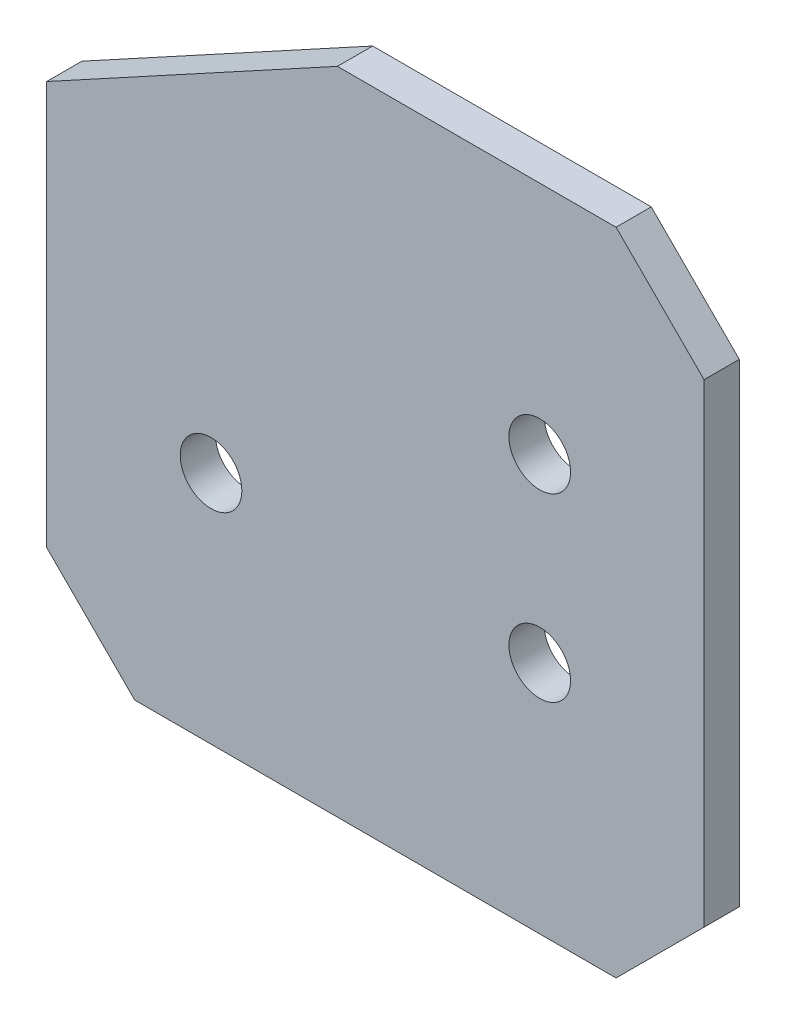
ISO-10303-21;
HEADER;
FILE_DESCRIPTION(('STEP AP214'),'2;1');
FILE_NAME('part.step','',(''),(''),'','','');
FILE_SCHEMA(('AUTOMOTIVE_DESIGN { 1 0 10303 214 1 1 1 1 }'));
ENDSEC;
DATA;
#1=APPLICATION_CONTEXT('core data for automotive mechanical design processes');
#2=APPLICATION_PROTOCOL_DEFINITION('international standard','automotive_design',2000,#1);
#3=PRODUCT_CONTEXT('',#1,'mechanical');
#4=PRODUCT('Part','Part','',(#3));
#5=PRODUCT_RELATED_PRODUCT_CATEGORY('part','',(#4));
#6=PRODUCT_DEFINITION_FORMATION('','',#4);
#7=PRODUCT_DEFINITION_CONTEXT('part definition',#1,'design');
#8=PRODUCT_DEFINITION('design','',#6,#7);
#9=PRODUCT_DEFINITION_SHAPE('','',#8);
#10=(LENGTH_UNIT() NAMED_UNIT(*) SI_UNIT(.MILLI.,.METRE.));
#11=(NAMED_UNIT(*) PLANE_ANGLE_UNIT() SI_UNIT($,.RADIAN.));
#12=(NAMED_UNIT(*) SI_UNIT($,.STERADIAN.) SOLID_ANGLE_UNIT());
#13=UNCERTAINTY_MEASURE_WITH_UNIT(LENGTH_MEASURE(1.E-05),#10,'distance_accuracy_value','');
#14=(GEOMETRIC_REPRESENTATION_CONTEXT(3) GLOBAL_UNCERTAINTY_ASSIGNED_CONTEXT((#13)) GLOBAL_UNIT_ASSIGNED_CONTEXT((#10,
#11,#12)) REPRESENTATION_CONTEXT('',''));
#15=CARTESIAN_POINT('',(0.,0.,0.));
#16=DIRECTION('',(0.,0.,1.));
#17=DIRECTION('',(1.,0.,0.));
#18=AXIS2_PLACEMENT_3D('',#15,#16,#17);
#19=CARTESIAN_POINT('',(55.9999999999995,3.00000000000045,-6.00000000000001));
#20=DIRECTION('',(1.,0.,0.));
#21=DIRECTION('',(0.,1.,0.));
#22=AXIS2_PLACEMENT_3D('',#19,#20,#21);
#23=PLANE('',#22);
#24=DIRECTION('',(0.,1.,0.));
#25=VECTOR('',#24,1.);
#26=CARTESIAN_POINT('',(55.9999999999995,3.00000000000045,0.));
#27=LINE('',#26,#25);
#28=CARTESIAN_POINT('',(55.9999999999993,18.0000000000005,0.));
#29=VERTEX_POINT('',#28);
#30=CARTESIAN_POINT('',(55.9999999999988,98.7738106804796,0.));
#31=VERTEX_POINT('',#30);
#32=EDGE_CURVE('E118',#29,#31,#27,.T.);
#33=ORIENTED_EDGE('',*,*,#32,.F.);
#34=DIRECTION('',(0.,0.,-1.));
#35=VECTOR('',#34,1.);
#36=CARTESIAN_POINT('',(55.9999999999993,18.0000000000005,-6.00000000000001));
#37=LINE('',#36,#35);
#38=CARTESIAN_POINT('',(55.9999999999993,18.0000000000005,-6.00000000000001));
#39=VERTEX_POINT('',#38);
#40=EDGE_CURVE('E143',#29,#39,#37,.T.);
#41=ORIENTED_EDGE('',*,*,#40,.T.);
#42=DIRECTION('',(0.,1.,0.));
#43=VECTOR('',#42,1.);
#44=CARTESIAN_POINT('',(55.9999999999995,3.00000000000045,-6.00000000000001));
#45=LINE('',#44,#43);
#46=CARTESIAN_POINT('',(55.9999999999988,98.7738106804796,-6.00000000000001));
#47=VERTEX_POINT('',#46);
#48=EDGE_CURVE('E128',#39,#47,#45,.T.);
#49=ORIENTED_EDGE('',*,*,#48,.T.);
#50=DIRECTION('',(0.,0.,1.));
#51=VECTOR('',#50,1.);
#52=CARTESIAN_POINT('',(55.9999999999988,98.7738106804796,-6.00000000000001));
#53=LINE('',#52,#51);
#54=EDGE_CURVE('E140',#47,#31,#53,.T.);
#55=ORIENTED_EDGE('',*,*,#54,.T.);
#56=EDGE_LOOP('',(#33,#41,#49,#55));
#57=FACE_BOUND('',#56,.T.);
#58=ADVANCED_FACE('F38',(#57),#23,.T.);
#59=CARTESIAN_POINT('',(55.9999999999995,3.00000000000045,-6.00000000000001));
#60=DIRECTION('',(0.,-1.,0.));
#61=DIRECTION('',(1.,0.,0.));
#62=AXIS2_PLACEMENT_3D('',#59,#60,#61);
#63=PLANE('',#62);
#64=DIRECTION('',(1.,0.,0.));
#65=VECTOR('',#64,1.);
#66=CARTESIAN_POINT('',(55.9999999999995,3.00000000000045,-6.00000000000001));
#67=LINE('',#66,#65);
#68=CARTESIAN_POINT('',(-40.9999999999994,3.00000000000006,-6.00000000000001));
#69=VERTEX_POINT('',#68);
#70=CARTESIAN_POINT('',(40.9999999999995,3.00000000000039,-6.00000000000001));
#71=VERTEX_POINT('',#70);
#72=EDGE_CURVE('E132',#69,#71,#67,.T.);
#73=ORIENTED_EDGE('',*,*,#72,.T.);
#74=DIRECTION('',(0.,0.,1.));
#75=VECTOR('',#74,1.);
#76=CARTESIAN_POINT('',(40.9999999999995,3.00000000000039,-6.00000000000001));
#77=LINE('',#76,#75);
#78=CARTESIAN_POINT('',(40.9999999999995,3.00000000000039,0.));
#79=VERTEX_POINT('',#78);
#80=EDGE_CURVE('E131',#71,#79,#77,.T.);
#81=ORIENTED_EDGE('',*,*,#80,.T.);
#82=DIRECTION('',(1.,0.,0.));
#83=VECTOR('',#82,1.);
#84=CARTESIAN_POINT('',(55.9999999999995,3.00000000000045,0.));
#85=LINE('',#84,#83);
#86=CARTESIAN_POINT('',(-40.9999999999994,3.00000000000006,0.));
#87=VERTEX_POINT('',#86);
#88=EDGE_CURVE('E120',#87,#79,#85,.T.);
#89=ORIENTED_EDGE('',*,*,#88,.F.);
#90=DIRECTION('',(0.,0.,-1.));
#91=VECTOR('',#90,1.);
#92=CARTESIAN_POINT('',(-40.9999999999994,3.00000000000006,-6.00000000000001));
#93=LINE('',#92,#91);
#94=EDGE_CURVE('E129',#87,#69,#93,.T.);
#95=ORIENTED_EDGE('',*,*,#94,.T.);
#96=EDGE_LOOP('',(#73,#81,#89,#95));
#97=FACE_BOUND('',#96,.T.);
#98=ADVANCED_FACE('F165',(#97),#63,.T.);
#99=CARTESIAN_POINT('',(-55.9999999999995,3.,-6.00000000000001));
#100=DIRECTION('',(-1.,0.,0.));
#101=DIRECTION('',(0.,0.,1.));
#102=AXIS2_PLACEMENT_3D('',#99,#100,#101);
#103=PLANE('',#102);
#104=DIRECTION('',(0.,0.,1.));
#105=VECTOR('',#104,1.);
#106=CARTESIAN_POINT('',(-55.9999999999995,86.7684486211549,-10.));
#107=LINE('',#106,#105);
#108=CARTESIAN_POINT('',(-55.9999999999995,86.7684486211549,-6.00000000000001));
#109=VERTEX_POINT('',#108);
#110=CARTESIAN_POINT('',(-55.9999999999995,86.7684486211549,0.));
#111=VERTEX_POINT('',#110);
#112=EDGE_CURVE('E53',#109,#111,#107,.T.);
#113=ORIENTED_EDGE('',*,*,#112,.F.);
#114=DIRECTION('',(0.,-1.,0.));
#115=VECTOR('',#114,1.);
#116=CARTESIAN_POINT('',(-55.9999999999995,3.,-6.00000000000001));
#117=LINE('',#116,#115);
#118=CARTESIAN_POINT('',(-55.9999999999995,17.9999999999999,-6.00000000000001));
#119=VERTEX_POINT('',#118);
#120=EDGE_CURVE('E156',#109,#119,#117,.T.);
#121=ORIENTED_EDGE('',*,*,#120,.T.);
#122=DIRECTION('',(0.,0.,1.));
#123=VECTOR('',#122,1.);
#124=CARTESIAN_POINT('',(-55.9999999999995,17.9999999999999,-6.00000000000001));
#125=LINE('',#124,#123);
#126=CARTESIAN_POINT('',(-55.9999999999995,17.9999999999999,0.));
#127=VERTEX_POINT('',#126);
#128=EDGE_CURVE('E46',#119,#127,#125,.T.);
#129=ORIENTED_EDGE('',*,*,#128,.T.);
#130=DIRECTION('',(0.,-1.,0.));
#131=VECTOR('',#130,1.);
#132=CARTESIAN_POINT('',(-55.9999999999995,3.,0.));
#133=LINE('',#132,#131);
#134=EDGE_CURVE('E117',#111,#127,#133,.T.);
#135=ORIENTED_EDGE('',*,*,#134,.F.);
#136=EDGE_LOOP('',(#113,#121,#129,#135));
#137=FACE_BOUND('',#136,.T.);
#138=ADVANCED_FACE('F154',(#137),#103,.T.);
#139=CARTESIAN_POINT('',(-55.9999999999995,113.773810680479,-6.00000000000001));
#140=DIRECTION('',(0.,1.,0.));
#141=DIRECTION('',(-1.,0.,0.));
#142=AXIS2_PLACEMENT_3D('',#139,#140,#141);
#143=PLANE('',#142);
#144=DIRECTION('',(0.,0.,1.));
#145=VECTOR('',#144,1.);
#146=CARTESIAN_POINT('',(-6.46850911170526,113.773810680479,-10.));
#147=LINE('',#146,#145);
#148=CARTESIAN_POINT('',(-6.46850911170526,113.773810680479,-6.00000000000001));
#149=VERTEX_POINT('',#148);
#150=CARTESIAN_POINT('',(-6.46850911170526,113.773810680479,0.));
#151=VERTEX_POINT('',#150);
#152=EDGE_CURVE('E103',#149,#151,#147,.T.);
#153=ORIENTED_EDGE('',*,*,#152,.T.);
#154=DIRECTION('',(-1.,0.,0.));
#155=VECTOR('',#154,1.);
#156=CARTESIAN_POINT('',(-55.9999999999995,113.773810680479,0.));
#157=LINE('',#156,#155);
#158=CARTESIAN_POINT('',(40.9999999999986,113.77381068048,0.));
#159=VERTEX_POINT('',#158);
#160=EDGE_CURVE('E110',#159,#151,#157,.T.);
#161=ORIENTED_EDGE('',*,*,#160,.F.);
#162=DIRECTION('',(0.,0.,-1.));
#163=VECTOR('',#162,1.);
#164=CARTESIAN_POINT('',(40.9999999999986,113.77381068048,-6.00000000000001));
#165=LINE('',#164,#163);
#166=CARTESIAN_POINT('',(40.9999999999986,113.77381068048,-6.00000000000001));
#167=VERTEX_POINT('',#166);
#168=EDGE_CURVE('E11',#159,#167,#165,.T.);
#169=ORIENTED_EDGE('',*,*,#168,.T.);
#170=DIRECTION('',(-1.,0.,0.));
#171=VECTOR('',#170,1.);
#172=CARTESIAN_POINT('',(-55.9999999999995,113.773810680479,-6.00000000000001));
#173=LINE('',#172,#171);
#174=EDGE_CURVE('E111',#167,#149,#173,.T.);
#175=ORIENTED_EDGE('',*,*,#174,.T.);
#176=EDGE_LOOP('',(#153,#161,#169,#175));
#177=FACE_BOUND('',#176,.T.);
#178=ADVANCED_FACE('F109',(#177),#143,.T.);
#179=CARTESIAN_POINT('',(0.,0.,-6.00000000000001));
#180=DIRECTION('',(0.,0.,-1.));
#181=DIRECTION('',(-1.,0.,0.));
#182=AXIS2_PLACEMENT_3D('',#179,#180,#181);
#183=PLANE('',#182);
#184=DIRECTION('',(-0.877983597106914,-0.478690717699021,0.));
#185=VECTOR('',#184,1.);
#186=CARTESIAN_POINT('',(-49.2993780104589,90.421735037635,-6.00000000000001));
#187=LINE('',#186,#185);
#188=EDGE_CURVE('E112',#149,#109,#187,.T.);
#189=ORIENTED_EDGE('',*,*,#188,.F.);
#190=ORIENTED_EDGE('',*,*,#174,.F.);
#191=DIRECTION('',(-0.707106781186551,0.707106781186544,0.));
#192=VECTOR('',#191,1.);
#193=CARTESIAN_POINT('',(77.3869053402389,77.3869053402397,-6.00000000000001));
#194=LINE('',#193,#192);
#195=EDGE_CURVE('E145',#167,#47,#194,.F.);
#196=ORIENTED_EDGE('',*,*,#195,.T.);
#197=ORIENTED_EDGE('',*,*,#48,.F.);
#198=DIRECTION('',(0.707106781186542,0.707106781186553,0.));
#199=VECTOR('',#198,1.);
#200=CARTESIAN_POINT('',(18.9999999999999,-18.9999999999996,-6.00000000000001));
#201=LINE('',#200,#199);
#202=EDGE_CURVE('E150',#39,#71,#201,.F.);
#203=ORIENTED_EDGE('',*,*,#202,.T.);
#204=ORIENTED_EDGE('',*,*,#72,.F.);
#205=DIRECTION('',(0.707106781186552,-0.707106781186543,0.));
#206=VECTOR('',#205,1.);
#207=CARTESIAN_POINT('',(-18.9999999999994,-18.9999999999997,-6.00000000000001));
#208=LINE('',#207,#206);
#209=EDGE_CURVE('E147',#69,#119,#208,.F.);
#210=ORIENTED_EDGE('',*,*,#209,.T.);
#211=ORIENTED_EDGE('',*,*,#120,.F.);
#212=EDGE_LOOP('',(#189,#190,#196,#197,#203,#204,#210,#211));
#213=FACE_BOUND('',#212,.T.);
#214=CARTESIAN_POINT('',(27.9999999999997,43.,-6.00000000000001));
#215=DIRECTION('',(0.,0.,1.));
#216=DIRECTION('',(-1.,0.,0.));
#217=AXIS2_PLACEMENT_3D('',#214,#215,#216);
#218=CIRCLE('',#217,5.25);
#219=CARTESIAN_POINT('',(22.7499999999997,43.,-6.00000000000001));
#220=VERTEX_POINT('',#219);
#221=EDGE_CURVE('E195',#220,#220,#218,.T.);
#222=ORIENTED_EDGE('',*,*,#221,.T.);
#223=EDGE_LOOP('',(#222));
#224=FACE_BOUND('',#223,.T.);
#225=CARTESIAN_POINT('',(27.9999999999994,73.7738106804792,-6.00000000000001));
#226=DIRECTION('',(0.,0.,1.));
#227=DIRECTION('',(-1.,0.,0.));
#228=AXIS2_PLACEMENT_3D('',#225,#226,#227);
#229=CIRCLE('',#228,5.25000000000001);
#230=CARTESIAN_POINT('',(22.7499999999994,73.7738106804792,-6.00000000000001));
#231=VERTEX_POINT('',#230);
#232=EDGE_CURVE('E189',#231,#231,#229,.T.);
#233=ORIENTED_EDGE('',*,*,#232,.T.);
#234=EDGE_LOOP('',(#233));
#235=FACE_BOUND('',#234,.T.);
#236=CARTESIAN_POINT('',(-28.,43.,-6.00000000000001));
#237=DIRECTION('',(0.,0.,1.));
#238=DIRECTION('',(1.,0.,0.));
#239=AXIS2_PLACEMENT_3D('',#236,#237,#238);
#240=CIRCLE('',#239,5.25);
#241=CARTESIAN_POINT('',(-22.75,43.,-6.00000000000001));
#242=VERTEX_POINT('',#241);
#243=EDGE_CURVE('E122',#242,#242,#240,.T.);
#244=ORIENTED_EDGE('',*,*,#243,.T.);
#245=EDGE_LOOP('',(#244));
#246=FACE_BOUND('',#245,.T.);
#247=ADVANCED_FACE('F180',(#213,#224,#235,#246),#183,.T.);
#248=CARTESIAN_POINT('',(0.,0.,0.));
#249=DIRECTION('',(0.,0.,-1.));
#250=DIRECTION('',(-1.,0.,0.));
#251=AXIS2_PLACEMENT_3D('',#248,#249,#250);
#252=PLANE('',#251);
#253=CARTESIAN_POINT('',(27.9999999999997,43.,0.));
#254=DIRECTION('',(0.,0.,1.));
#255=DIRECTION('',(-1.,0.,0.));
#256=AXIS2_PLACEMENT_3D('',#253,#254,#255);
#257=CIRCLE('',#256,5.25);
#258=CARTESIAN_POINT('',(22.7499999999997,43.,0.));
#259=VERTEX_POINT('',#258);
#260=EDGE_CURVE('E198',#259,#259,#257,.T.);
#261=ORIENTED_EDGE('',*,*,#260,.F.);
#262=EDGE_LOOP('',(#261));
#263=FACE_BOUND('',#262,.T.);
#264=CARTESIAN_POINT('',(27.9999999999994,73.7738106804792,0.));
#265=DIRECTION('',(0.,0.,1.));
#266=DIRECTION('',(-1.,0.,0.));
#267=AXIS2_PLACEMENT_3D('',#264,#265,#266);
#268=CIRCLE('',#267,5.25000000000001);
#269=CARTESIAN_POINT('',(22.7499999999994,73.7738106804792,0.));
#270=VERTEX_POINT('',#269);
#271=EDGE_CURVE('E192',#270,#270,#268,.T.);
#272=ORIENTED_EDGE('',*,*,#271,.F.);
#273=EDGE_LOOP('',(#272));
#274=FACE_BOUND('',#273,.T.);
#275=CARTESIAN_POINT('',(-28.,43.,0.));
#276=DIRECTION('',(0.,0.,1.));
#277=DIRECTION('',(1.,0.,0.));
#278=AXIS2_PLACEMENT_3D('',#275,#276,#277);
#279=CIRCLE('',#278,5.25);
#280=CARTESIAN_POINT('',(-22.75,43.,0.));
#281=VERTEX_POINT('',#280);
#282=EDGE_CURVE('E186',#281,#281,#279,.T.);
#283=ORIENTED_EDGE('',*,*,#282,.F.);
#284=EDGE_LOOP('',(#283));
#285=FACE_BOUND('',#284,.T.);
#286=ORIENTED_EDGE('',*,*,#160,.T.);
#287=DIRECTION('',(0.877983597106914,0.478690717699021,0.));
#288=VECTOR('',#287,1.);
#289=CARTESIAN_POINT('',(-55.9999999999995,86.7684486211549,0.));
#290=LINE('',#289,#288);
#291=EDGE_CURVE('E100',#111,#151,#290,.T.);
#292=ORIENTED_EDGE('',*,*,#291,.F.);
#293=ORIENTED_EDGE('',*,*,#134,.T.);
#294=DIRECTION('',(-0.707106781186552,0.707106781186543,0.));
#295=VECTOR('',#294,1.);
#296=CARTESIAN_POINT('',(-55.9999999999995,17.9999999999999,0.));
#297=LINE('',#296,#295);
#298=EDGE_CURVE('E136',#127,#87,#297,.F.);
#299=ORIENTED_EDGE('',*,*,#298,.T.);
#300=ORIENTED_EDGE('',*,*,#88,.T.);
#301=DIRECTION('',(-0.707106781186542,-0.707106781186553,0.));
#302=VECTOR('',#301,1.);
#303=CARTESIAN_POINT('',(40.9999999999995,3.00000000000039,0.));
#304=LINE('',#303,#302);
#305=EDGE_CURVE('E138',#79,#29,#304,.F.);
#306=ORIENTED_EDGE('',*,*,#305,.T.);
#307=ORIENTED_EDGE('',*,*,#32,.T.);
#308=DIRECTION('',(0.707106781186551,-0.707106781186544,0.));
#309=VECTOR('',#308,1.);
#310=CARTESIAN_POINT('',(55.9999999999988,98.7738106804796,0.));
#311=LINE('',#310,#309);
#312=EDGE_CURVE('E116',#31,#159,#311,.F.);
#313=ORIENTED_EDGE('',*,*,#312,.T.);
#314=EDGE_LOOP('',(#286,#292,#293,#299,#300,#306,#307,#313));
#315=FACE_BOUND('',#314,.T.);
#316=ADVANCED_FACE('F114',(#263,#274,#285,#315),#252,.F.);
#317=CARTESIAN_POINT('',(-28.,43.,-6.00000000000001));
#318=DIRECTION('',(0.,0.,1.));
#319=DIRECTION('',(1.,0.,0.));
#320=AXIS2_PLACEMENT_3D('',#317,#318,#319);
#321=CYLINDRICAL_SURFACE('',#320,5.25);
#322=ORIENTED_EDGE('',*,*,#243,.F.);
#323=EDGE_LOOP('',(#322));
#324=FACE_BOUND('',#323,.T.);
#325=ORIENTED_EDGE('',*,*,#282,.T.);
#326=EDGE_LOOP('',(#325));
#327=FACE_BOUND('',#326,.T.);
#328=ADVANCED_FACE('F216',(#324,#327),#321,.F.);
#329=CARTESIAN_POINT('',(27.9999999999994,73.7738106804792,-6.00000000000001));
#330=DIRECTION('',(0.,0.,1.));
#331=DIRECTION('',(1.,0.,0.));
#332=AXIS2_PLACEMENT_3D('',#329,#330,#331);
#333=CYLINDRICAL_SURFACE('',#332,5.25000000000001);
#334=ORIENTED_EDGE('',*,*,#232,.F.);
#335=EDGE_LOOP('',(#334));
#336=FACE_BOUND('',#335,.T.);
#337=ORIENTED_EDGE('',*,*,#271,.T.);
#338=EDGE_LOOP('',(#337));
#339=FACE_BOUND('',#338,.T.);
#340=ADVANCED_FACE('F210',(#336,#339),#333,.F.);
#341=CARTESIAN_POINT('',(27.9999999999997,43.,-6.00000000000001));
#342=DIRECTION('',(0.,0.,1.));
#343=DIRECTION('',(1.,0.,0.));
#344=AXIS2_PLACEMENT_3D('',#341,#342,#343);
#345=CYLINDRICAL_SURFACE('',#344,5.25);
#346=ORIENTED_EDGE('',*,*,#221,.F.);
#347=EDGE_LOOP('',(#346));
#348=FACE_BOUND('',#347,.T.);
#349=ORIENTED_EDGE('',*,*,#260,.T.);
#350=EDGE_LOOP('',(#349));
#351=FACE_BOUND('',#350,.T.);
#352=ADVANCED_FACE('F207',(#348,#351),#345,.F.);
#353=CARTESIAN_POINT('',(40.9999999999995,3.00000000000039,-6.00000000000001));
#354=DIRECTION('',(-0.707106781186553,0.707106781186542,0.));
#355=DIRECTION('',(0.,0.,1.));
#356=AXIS2_PLACEMENT_3D('',#353,#354,#355);
#357=PLANE('',#356);
#358=ORIENTED_EDGE('',*,*,#202,.F.);
#359=ORIENTED_EDGE('',*,*,#40,.F.);
#360=ORIENTED_EDGE('',*,*,#305,.F.);
#361=ORIENTED_EDGE('',*,*,#80,.F.);
#362=EDGE_LOOP('',(#358,#359,#360,#361));
#363=FACE_BOUND('',#362,.T.);
#364=ADVANCED_FACE('F170',(#363),#357,.F.);
#365=CARTESIAN_POINT('',(-55.9999999999995,17.9999999999999,-6.00000000000001));
#366=DIRECTION('',(0.707106781186543,0.707106781186552,0.));
#367=DIRECTION('',(0.,0.,1.));
#368=AXIS2_PLACEMENT_3D('',#365,#366,#367);
#369=PLANE('',#368);
#370=ORIENTED_EDGE('',*,*,#209,.F.);
#371=ORIENTED_EDGE('',*,*,#94,.F.);
#372=ORIENTED_EDGE('',*,*,#298,.F.);
#373=ORIENTED_EDGE('',*,*,#128,.F.);
#374=EDGE_LOOP('',(#370,#371,#372,#373));
#375=FACE_BOUND('',#374,.T.);
#376=ADVANCED_FACE('F160',(#375),#369,.F.);
#377=CARTESIAN_POINT('',(55.9999999999988,98.7738106804796,-6.00000000000001));
#378=DIRECTION('',(-0.707106781186544,-0.707106781186551,0.));
#379=DIRECTION('',(0.,0.,1.));
#380=AXIS2_PLACEMENT_3D('',#377,#378,#379);
#381=PLANE('',#380);
#382=ORIENTED_EDGE('',*,*,#195,.F.);
#383=ORIENTED_EDGE('',*,*,#168,.F.);
#384=ORIENTED_EDGE('',*,*,#312,.F.);
#385=ORIENTED_EDGE('',*,*,#54,.F.);
#386=EDGE_LOOP('',(#382,#383,#384,#385));
#387=FACE_BOUND('',#386,.T.);
#388=ADVANCED_FACE('F40',(#387),#381,.F.);
#389=CARTESIAN_POINT('',(-55.9999999999995,86.7684486211549,-10.));
#390=DIRECTION('',(0.478690717699021,-0.877983597106914,0.));
#391=DIRECTION('',(0.877983597106914,0.478690717699021,0.));
#392=AXIS2_PLACEMENT_3D('',#389,#390,#391);
#393=PLANE('',#392);
#394=ORIENTED_EDGE('',*,*,#188,.T.);
#395=ORIENTED_EDGE('',*,*,#112,.T.);
#396=ORIENTED_EDGE('',*,*,#291,.T.);
#397=ORIENTED_EDGE('',*,*,#152,.F.);
#398=EDGE_LOOP('',(#394,#395,#396,#397));
#399=FACE_BOUND('',#398,.T.);
#400=ADVANCED_FACE('F102',(#399),#393,.F.);
#401=CLOSED_SHELL('',(#58,#98,#138,#178,#247,#316,#328,#340,#352,#364,#376,#388,#400));
#402=MANIFOLD_SOLID_BREP('B2',#401);
#403=ADVANCED_BREP_SHAPE_REPRESENTATION('',(#18,#402),#14);
#404=SHAPE_DEFINITION_REPRESENTATION(#9,#403);
ENDSEC;
END-ISO-10303-21;
